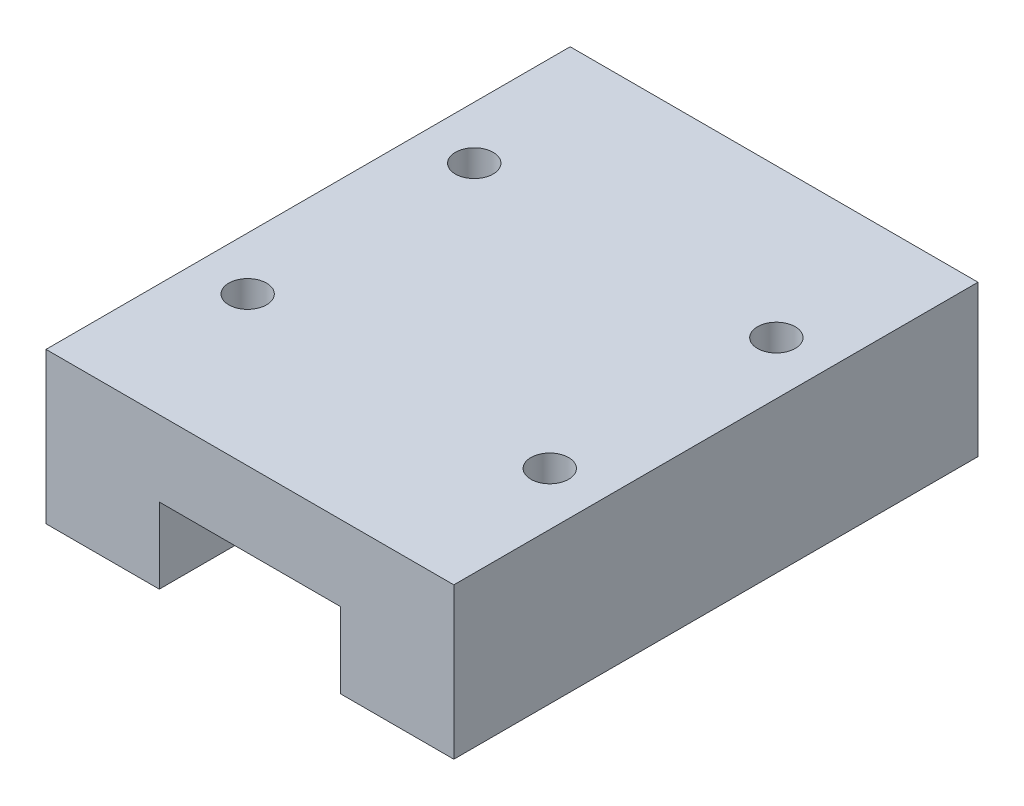
ISO-10303-21;
HEADER;
FILE_DESCRIPTION(('STEP AP214'),'2;1');
FILE_NAME('part.step','',(''),(''),'','','');
FILE_SCHEMA(('AUTOMOTIVE_DESIGN { 1 0 10303 214 1 1 1 1 }'));
ENDSEC;
DATA;
#1=APPLICATION_CONTEXT('core data for automotive mechanical design processes');
#2=APPLICATION_PROTOCOL_DEFINITION('international standard','automotive_design',2000,#1);
#3=PRODUCT_CONTEXT('',#1,'mechanical');
#4=PRODUCT('Part','Part','',(#3));
#5=PRODUCT_RELATED_PRODUCT_CATEGORY('part','',(#4));
#6=PRODUCT_DEFINITION_FORMATION('','',#4);
#7=PRODUCT_DEFINITION_CONTEXT('part definition',#1,'design');
#8=PRODUCT_DEFINITION('design','',#6,#7);
#9=PRODUCT_DEFINITION_SHAPE('','',#8);
#10=(LENGTH_UNIT() NAMED_UNIT(*) SI_UNIT(.MILLI.,.METRE.));
#11=(NAMED_UNIT(*) PLANE_ANGLE_UNIT() SI_UNIT($,.RADIAN.));
#12=(NAMED_UNIT(*) SI_UNIT($,.STERADIAN.) SOLID_ANGLE_UNIT());
#13=UNCERTAINTY_MEASURE_WITH_UNIT(LENGTH_MEASURE(1.E-05),#10,'distance_accuracy_value','');
#14=(GEOMETRIC_REPRESENTATION_CONTEXT(3) GLOBAL_UNCERTAINTY_ASSIGNED_CONTEXT((#13)) GLOBAL_UNIT_ASSIGNED_CONTEXT((#10,
#11,#12)) REPRESENTATION_CONTEXT('',''));
#15=CARTESIAN_POINT('',(0.,0.,0.));
#16=DIRECTION('',(0.,0.,1.));
#17=DIRECTION('',(1.,0.,0.));
#18=AXIS2_PLACEMENT_3D('',#15,#16,#17);
#19=CARTESIAN_POINT('',(3.5,3.99999999990541,9.85));
#20=DIRECTION('',(0.,1.,0.));
#21=DIRECTION('',(0.,0.,1.));
#22=AXIS2_PLACEMENT_3D('',#19,#20,#21);
#23=CONICAL_SURFACE('',#22,1.24999999988531,1.02974425865522);
#24=CARTESIAN_POINT('',(3.5,3.2489242261704,9.85));
#25=VERTEX_POINT('',#24);
#26=VERTEX_LOOP('',#25);
#27=FACE_BOUND('',#26,.T.);
#28=CARTESIAN_POINT('',(3.5,4.,9.85));
#29=DIRECTION('',(0.,1.,0.));
#30=DIRECTION('',(0.,0.,1.));
#31=AXIS2_PLACEMENT_3D('',#28,#29,#30);
#32=CIRCLE('',#31,1.24999999999999);
#33=CARTESIAN_POINT('',(3.5,4.,11.1));
#34=VERTEX_POINT('',#33);
#35=EDGE_CURVE('E94',#34,#34,#32,.T.);
#36=ORIENTED_EDGE('',*,*,#35,.T.);
#37=EDGE_LOOP('',(#36));
#38=FACE_BOUND('',#37,.T.);
#39=ADVANCED_FACE('F16',(#27,#38),#23,.F.);
#40=CARTESIAN_POINT('',(3.50000000000001,4.0000000000191,24.85));
#41=DIRECTION('',(0.,1.,0.));
#42=DIRECTION('',(0.,0.,1.));
#43=AXIS2_PLACEMENT_3D('',#40,#41,#42);
#44=CONICAL_SURFACE('',#43,1.24999999998536,1.02974425865232);
#45=CARTESIAN_POINT('',(3.50000000000001,3.24892422622725,24.85));
#46=VERTEX_POINT('',#45);
#47=VERTEX_LOOP('',#46);
#48=FACE_BOUND('',#47,.T.);
#49=CARTESIAN_POINT('',(3.50000000000001,4.,24.85));
#50=DIRECTION('',(0.,1.,0.));
#51=DIRECTION('',(0.,0.,1.));
#52=AXIS2_PLACEMENT_3D('',#49,#50,#51);
#53=CIRCLE('',#52,1.24999999999999);
#54=CARTESIAN_POINT('',(3.50000000000001,4.,26.1));
#55=VERTEX_POINT('',#54);
#56=EDGE_CURVE('E96',#55,#55,#53,.T.);
#57=ORIENTED_EDGE('',*,*,#56,.T.);
#58=EDGE_LOOP('',(#57));
#59=FACE_BOUND('',#58,.T.);
#60=ADVANCED_FACE('F91',(#48,#59),#44,.F.);
#61=CARTESIAN_POINT('',(23.5,3.99999999990541,24.85));
#62=DIRECTION('',(0.,1.,0.));
#63=DIRECTION('',(0.,0.,1.));
#64=AXIS2_PLACEMENT_3D('',#61,#62,#63);
#65=CONICAL_SURFACE('',#64,1.24999999987167,1.02974425844497);
#66=CARTESIAN_POINT('',(23.5,3.24892422608514,24.8500000002139));
#67=VERTEX_POINT('',#66);
#68=VERTEX_LOOP('',#67);
#69=FACE_BOUND('',#68,.T.);
#70=CARTESIAN_POINT('',(23.5,4.,24.85));
#71=DIRECTION('',(0.,1.,0.));
#72=DIRECTION('',(0.,0.,1.));
#73=AXIS2_PLACEMENT_3D('',#70,#71,#72);
#74=CIRCLE('',#73,1.24999999999999);
#75=CARTESIAN_POINT('',(23.5,4.,26.1));
#76=VERTEX_POINT('',#75);
#77=EDGE_CURVE('E100',#76,#76,#74,.T.);
#78=ORIENTED_EDGE('',*,*,#77,.T.);
#79=EDGE_LOOP('',(#78));
#80=FACE_BOUND('',#79,.T.);
#81=ADVANCED_FACE('F177',(#69,#80),#65,.F.);
#82=CARTESIAN_POINT('',(23.5,3.99999999990541,9.85));
#83=DIRECTION('',(0.,1.,0.));
#84=DIRECTION('',(0.,0.,1.));
#85=AXIS2_PLACEMENT_3D('',#82,#83,#84);
#86=CONICAL_SURFACE('',#85,1.24999999994215,1.02974425842119);
#87=CARTESIAN_POINT('',(23.5,3.24892422611356,9.85000000014224));
#88=VERTEX_POINT('',#87);
#89=VERTEX_LOOP('',#88);
#90=FACE_BOUND('',#89,.T.);
#91=CARTESIAN_POINT('',(23.5,4.,9.85));
#92=DIRECTION('',(0.,1.,0.));
#93=DIRECTION('',(0.,0.,1.));
#94=AXIS2_PLACEMENT_3D('',#91,#92,#93);
#95=CIRCLE('',#94,1.24999999999999);
#96=CARTESIAN_POINT('',(23.5,4.,11.1));
#97=VERTEX_POINT('',#96);
#98=EDGE_CURVE('E164',#97,#97,#95,.T.);
#99=ORIENTED_EDGE('',*,*,#98,.T.);
#100=EDGE_LOOP('',(#99));
#101=FACE_BOUND('',#100,.T.);
#102=ADVANCED_FACE('F242',(#90,#101),#86,.F.);
#103=CARTESIAN_POINT('',(7.5,0.,34.7));
#104=DIRECTION('',(0.,1.,0.));
#105=DIRECTION('',(-1.,0.,0.));
#106=AXIS2_PLACEMENT_3D('',#103,#104,#105);
#107=PLANE('',#106);
#108=DIRECTION('',(0.,0.,1.));
#109=VECTOR('',#108,1.);
#110=CARTESIAN_POINT('',(7.5,0.,34.7));
#111=LINE('',#110,#109);
#112=CARTESIAN_POINT('',(7.5,0.,0.));
#113=VERTEX_POINT('',#112);
#114=CARTESIAN_POINT('',(7.5,0.,34.7));
#115=VERTEX_POINT('',#114);
#116=EDGE_CURVE('E103',#113,#115,#111,.T.);
#117=ORIENTED_EDGE('',*,*,#116,.T.);
#118=DIRECTION('',(-1.,0.,0.));
#119=VECTOR('',#118,1.);
#120=CARTESIAN_POINT('',(0.,0.,34.7));
#121=LINE('',#120,#119);
#122=CARTESIAN_POINT('',(0.,0.,34.7));
#123=VERTEX_POINT('',#122);
#124=EDGE_CURVE('E146',#115,#123,#121,.T.);
#125=ORIENTED_EDGE('',*,*,#124,.T.);
#126=DIRECTION('',(0.,0.,-1.));
#127=VECTOR('',#126,1.);
#128=CARTESIAN_POINT('',(0.,0.,34.7));
#129=LINE('',#128,#127);
#130=CARTESIAN_POINT('',(0.,0.,0.));
#131=VERTEX_POINT('',#130);
#132=EDGE_CURVE('E140',#123,#131,#129,.T.);
#133=ORIENTED_EDGE('',*,*,#132,.T.);
#134=DIRECTION('',(-1.,0.,0.));
#135=VECTOR('',#134,1.);
#136=CARTESIAN_POINT('',(0.,0.,0.));
#137=LINE('',#136,#135);
#138=EDGE_CURVE('E138',#113,#131,#137,.T.);
#139=ORIENTED_EDGE('',*,*,#138,.F.);
#140=EDGE_LOOP('',(#117,#125,#133,#139));
#141=FACE_BOUND('',#140,.T.);
#142=ADVANCED_FACE('F238',(#141),#107,.F.);
#143=CARTESIAN_POINT('',(27.,0.,34.7));
#144=DIRECTION('',(0.,1.,0.));
#145=DIRECTION('',(-1.,0.,0.));
#146=AXIS2_PLACEMENT_3D('',#143,#144,#145);
#147=PLANE('',#146);
#148=DIRECTION('',(0.,0.,1.));
#149=VECTOR('',#148,1.);
#150=CARTESIAN_POINT('',(27.,0.,34.7));
#151=LINE('',#150,#149);
#152=CARTESIAN_POINT('',(27.,0.,0.));
#153=VERTEX_POINT('',#152);
#154=CARTESIAN_POINT('',(27.,0.,34.7));
#155=VERTEX_POINT('',#154);
#156=EDGE_CURVE('E163',#153,#155,#151,.T.);
#157=ORIENTED_EDGE('',*,*,#156,.T.);
#158=DIRECTION('',(-1.,0.,0.));
#159=VECTOR('',#158,1.);
#160=CARTESIAN_POINT('',(0.,0.,34.7));
#161=LINE('',#160,#159);
#162=CARTESIAN_POINT('',(19.5,0.,34.7));
#163=VERTEX_POINT('',#162);
#164=EDGE_CURVE('E157',#155,#163,#161,.T.);
#165=ORIENTED_EDGE('',*,*,#164,.T.);
#166=DIRECTION('',(0.,0.,-1.));
#167=VECTOR('',#166,1.);
#168=CARTESIAN_POINT('',(19.5,0.,34.7));
#169=LINE('',#168,#167);
#170=CARTESIAN_POINT('',(19.5,0.,0.));
#171=VERTEX_POINT('',#170);
#172=EDGE_CURVE('E170',#163,#171,#169,.T.);
#173=ORIENTED_EDGE('',*,*,#172,.T.);
#174=DIRECTION('',(-1.,0.,0.));
#175=VECTOR('',#174,1.);
#176=CARTESIAN_POINT('',(0.,0.,0.));
#177=LINE('',#176,#175);
#178=EDGE_CURVE('E132',#153,#171,#177,.T.);
#179=ORIENTED_EDGE('',*,*,#178,.F.);
#180=EDGE_LOOP('',(#157,#165,#173,#179));
#181=FACE_BOUND('',#180,.T.);
#182=ADVANCED_FACE('F234',(#181),#147,.F.);
#183=CARTESIAN_POINT('',(19.5,0.,34.7));
#184=DIRECTION('',(1.,0.,0.));
#185=DIRECTION('',(0.,0.,-1.));
#186=AXIS2_PLACEMENT_3D('',#183,#184,#185);
#187=PLANE('',#186);
#188=ORIENTED_EDGE('',*,*,#172,.F.);
#189=DIRECTION('',(0.,1.,0.));
#190=VECTOR('',#189,1.);
#191=CARTESIAN_POINT('',(19.5,0.,34.7));
#192=LINE('',#191,#190);
#193=CARTESIAN_POINT('',(19.5,5.,34.7));
#194=VERTEX_POINT('',#193);
#195=EDGE_CURVE('E154',#163,#194,#192,.T.);
#196=ORIENTED_EDGE('',*,*,#195,.T.);
#197=DIRECTION('',(0.,0.,1.));
#198=VECTOR('',#197,1.);
#199=CARTESIAN_POINT('',(19.5,5.,34.7));
#200=LINE('',#199,#198);
#201=CARTESIAN_POINT('',(19.5,5.,0.));
#202=VERTEX_POINT('',#201);
#203=EDGE_CURVE('E167',#194,#202,#200,.F.);
#204=ORIENTED_EDGE('',*,*,#203,.T.);
#205=DIRECTION('',(0.,1.,0.));
#206=VECTOR('',#205,1.);
#207=CARTESIAN_POINT('',(19.5,0.,0.));
#208=LINE('',#207,#206);
#209=EDGE_CURVE('E126',#171,#202,#208,.T.);
#210=ORIENTED_EDGE('',*,*,#209,.F.);
#211=EDGE_LOOP('',(#188,#196,#204,#210));
#212=FACE_BOUND('',#211,.T.);
#213=ADVANCED_FACE('F230',(#212),#187,.F.);
#214=CARTESIAN_POINT('',(19.5,5.,34.7));
#215=DIRECTION('',(0.,1.,0.));
#216=DIRECTION('',(-1.,0.,0.));
#217=AXIS2_PLACEMENT_3D('',#214,#215,#216);
#218=PLANE('',#217);
#219=ORIENTED_EDGE('',*,*,#203,.F.);
#220=DIRECTION('',(-1.,0.,0.));
#221=VECTOR('',#220,1.);
#222=CARTESIAN_POINT('',(0.,5.,34.7));
#223=LINE('',#222,#221);
#224=CARTESIAN_POINT('',(7.5,5.,34.7));
#225=VERTEX_POINT('',#224);
#226=EDGE_CURVE('E151',#194,#225,#223,.T.);
#227=ORIENTED_EDGE('',*,*,#226,.T.);
#228=DIRECTION('',(0.,0.,1.));
#229=VECTOR('',#228,1.);
#230=CARTESIAN_POINT('',(7.5,5.,34.7));
#231=LINE('',#230,#229);
#232=CARTESIAN_POINT('',(7.5,5.,0.));
#233=VERTEX_POINT('',#232);
#234=EDGE_CURVE('E97',#225,#233,#231,.F.);
#235=ORIENTED_EDGE('',*,*,#234,.T.);
#236=DIRECTION('',(-1.,0.,0.));
#237=VECTOR('',#236,1.);
#238=CARTESIAN_POINT('',(0.,5.,0.));
#239=LINE('',#238,#237);
#240=EDGE_CURVE('E122',#202,#233,#239,.T.);
#241=ORIENTED_EDGE('',*,*,#240,.F.);
#242=EDGE_LOOP('',(#219,#227,#235,#241));
#243=FACE_BOUND('',#242,.T.);
#244=ADVANCED_FACE('F226',(#243),#218,.F.);
#245=CARTESIAN_POINT('',(7.5,5.,34.7));
#246=DIRECTION('',(-1.,0.,0.));
#247=DIRECTION('',(0.,-1.,0.));
#248=AXIS2_PLACEMENT_3D('',#245,#246,#247);
#249=PLANE('',#248);
#250=ORIENTED_EDGE('',*,*,#234,.F.);
#251=DIRECTION('',(0.,1.,0.));
#252=VECTOR('',#251,1.);
#253=CARTESIAN_POINT('',(7.5,0.,34.7));
#254=LINE('',#253,#252);
#255=EDGE_CURVE('E148',#225,#115,#254,.F.);
#256=ORIENTED_EDGE('',*,*,#255,.T.);
#257=ORIENTED_EDGE('',*,*,#116,.F.);
#258=DIRECTION('',(0.,1.,0.));
#259=VECTOR('',#258,1.);
#260=CARTESIAN_POINT('',(7.5,0.,0.));
#261=LINE('',#260,#259);
#262=EDGE_CURVE('E118',#233,#113,#261,.F.);
#263=ORIENTED_EDGE('',*,*,#262,.F.);
#264=EDGE_LOOP('',(#250,#256,#257,#263));
#265=FACE_BOUND('',#264,.T.);
#266=ADVANCED_FACE('F223',(#265),#249,.F.);
#267=CARTESIAN_POINT('',(3.5,10.,9.85));
#268=DIRECTION('',(0.,1.,0.));
#269=DIRECTION('',(0.,0.,1.));
#270=AXIS2_PLACEMENT_3D('',#267,#268,#269);
#271=CYLINDRICAL_SURFACE('',#270,1.24999999999999);
#272=ORIENTED_EDGE('',*,*,#35,.F.);
#273=EDGE_LOOP('',(#272));
#274=FACE_BOUND('',#273,.T.);
#275=CARTESIAN_POINT('',(3.5,10.,9.85));
#276=DIRECTION('',(0.,1.,0.));
#277=DIRECTION('',(0.,0.,1.));
#278=AXIS2_PLACEMENT_3D('',#275,#276,#277);
#279=CIRCLE('',#278,1.24999999999999);
#280=CARTESIAN_POINT('',(3.5,10.,11.1));
#281=VERTEX_POINT('',#280);
#282=EDGE_CURVE('E19',#281,#281,#279,.T.);
#283=ORIENTED_EDGE('',*,*,#282,.T.);
#284=EDGE_LOOP('',(#283));
#285=FACE_BOUND('',#284,.T.);
#286=ADVANCED_FACE('F219',(#274,#285),#271,.F.);
#287=CARTESIAN_POINT('',(3.50000000000001,10.,24.85));
#288=DIRECTION('',(0.,1.,0.));
#289=DIRECTION('',(0.,0.,1.));
#290=AXIS2_PLACEMENT_3D('',#287,#288,#289);
#291=CYLINDRICAL_SURFACE('',#290,1.24999999999999);
#292=ORIENTED_EDGE('',*,*,#56,.F.);
#293=EDGE_LOOP('',(#292));
#294=FACE_BOUND('',#293,.T.);
#295=CARTESIAN_POINT('',(3.50000000000001,10.,24.85));
#296=DIRECTION('',(0.,1.,0.));
#297=DIRECTION('',(0.,0.,1.));
#298=AXIS2_PLACEMENT_3D('',#295,#296,#297);
#299=CIRCLE('',#298,1.24999999999999);
#300=CARTESIAN_POINT('',(3.50000000000001,10.,26.1));
#301=VERTEX_POINT('',#300);
#302=EDGE_CURVE('E113',#301,#301,#299,.T.);
#303=ORIENTED_EDGE('',*,*,#302,.T.);
#304=EDGE_LOOP('',(#303));
#305=FACE_BOUND('',#304,.T.);
#306=ADVANCED_FACE('F183',(#294,#305),#291,.F.);
#307=CARTESIAN_POINT('',(23.5,10.,24.85));
#308=DIRECTION('',(0.,1.,0.));
#309=DIRECTION('',(0.,0.,1.));
#310=AXIS2_PLACEMENT_3D('',#307,#308,#309);
#311=CYLINDRICAL_SURFACE('',#310,1.24999999999999);
#312=ORIENTED_EDGE('',*,*,#77,.F.);
#313=EDGE_LOOP('',(#312));
#314=FACE_BOUND('',#313,.T.);
#315=CARTESIAN_POINT('',(23.5,10.,24.85));
#316=DIRECTION('',(0.,1.,0.));
#317=DIRECTION('',(0.,0.,1.));
#318=AXIS2_PLACEMENT_3D('',#315,#316,#317);
#319=CIRCLE('',#318,1.24999999999999);
#320=CARTESIAN_POINT('',(23.5,10.,26.1));
#321=VERTEX_POINT('',#320);
#322=EDGE_CURVE('E111',#321,#321,#319,.T.);
#323=ORIENTED_EDGE('',*,*,#322,.T.);
#324=EDGE_LOOP('',(#323));
#325=FACE_BOUND('',#324,.T.);
#326=ADVANCED_FACE('F179',(#314,#325),#311,.F.);
#327=CARTESIAN_POINT('',(23.5,10.,9.85));
#328=DIRECTION('',(0.,1.,0.));
#329=DIRECTION('',(0.,0.,1.));
#330=AXIS2_PLACEMENT_3D('',#327,#328,#329);
#331=CYLINDRICAL_SURFACE('',#330,1.24999999999999);
#332=ORIENTED_EDGE('',*,*,#98,.F.);
#333=EDGE_LOOP('',(#332));
#334=FACE_BOUND('',#333,.T.);
#335=CARTESIAN_POINT('',(23.5,10.,9.85));
#336=DIRECTION('',(0.,1.,0.));
#337=DIRECTION('',(0.,0.,1.));
#338=AXIS2_PLACEMENT_3D('',#335,#336,#337);
#339=CIRCLE('',#338,1.24999999999999);
#340=CARTESIAN_POINT('',(23.5,10.,11.1));
#341=VERTEX_POINT('',#340);
#342=EDGE_CURVE('E107',#341,#341,#339,.T.);
#343=ORIENTED_EDGE('',*,*,#342,.T.);
#344=EDGE_LOOP('',(#343));
#345=FACE_BOUND('',#344,.T.);
#346=ADVANCED_FACE('F182',(#334,#345),#331,.F.);
#347=CARTESIAN_POINT('',(27.,10.,34.7));
#348=DIRECTION('',(-1.,0.,0.));
#349=DIRECTION('',(0.,0.,1.));
#350=AXIS2_PLACEMENT_3D('',#347,#348,#349);
#351=PLANE('',#350);
#352=DIRECTION('',(0.,0.,1.));
#353=VECTOR('',#352,1.);
#354=CARTESIAN_POINT('',(27.,10.,34.7));
#355=LINE('',#354,#353);
#356=CARTESIAN_POINT('',(27.,10.,0.));
#357=VERTEX_POINT('',#356);
#358=CARTESIAN_POINT('',(27.,10.,34.7));
#359=VERTEX_POINT('',#358);
#360=EDGE_CURVE('E110',#357,#359,#355,.T.);
#361=ORIENTED_EDGE('',*,*,#360,.T.);
#362=DIRECTION('',(0.,1.,0.));
#363=VECTOR('',#362,1.);
#364=CARTESIAN_POINT('',(27.,0.,34.7));
#365=LINE('',#364,#363);
#366=EDGE_CURVE('E160',#359,#155,#365,.F.);
#367=ORIENTED_EDGE('',*,*,#366,.T.);
#368=ORIENTED_EDGE('',*,*,#156,.F.);
#369=DIRECTION('',(0.,1.,0.));
#370=VECTOR('',#369,1.);
#371=CARTESIAN_POINT('',(27.,0.,0.));
#372=LINE('',#371,#370);
#373=EDGE_CURVE('E134',#357,#153,#372,.F.);
#374=ORIENTED_EDGE('',*,*,#373,.F.);
#375=EDGE_LOOP('',(#361,#367,#368,#374));
#376=FACE_BOUND('',#375,.T.);
#377=ADVANCED_FACE('F209',(#376),#351,.F.);
#378=CARTESIAN_POINT('',(0.,0.,34.7));
#379=DIRECTION('',(0.,0.,-1.));
#380=DIRECTION('',(-1.,0.,0.));
#381=AXIS2_PLACEMENT_3D('',#378,#379,#380);
#382=PLANE('',#381);
#383=ORIENTED_EDGE('',*,*,#255,.F.);
#384=ORIENTED_EDGE('',*,*,#226,.F.);
#385=ORIENTED_EDGE('',*,*,#195,.F.);
#386=ORIENTED_EDGE('',*,*,#164,.F.);
#387=ORIENTED_EDGE('',*,*,#366,.F.);
#388=DIRECTION('',(1.,0.,0.));
#389=VECTOR('',#388,1.);
#390=CARTESIAN_POINT('',(0.,10.,34.7));
#391=LINE('',#390,#389);
#392=CARTESIAN_POINT('',(0.,10.,34.7));
#393=VERTEX_POINT('',#392);
#394=EDGE_CURVE('E387',#359,#393,#391,.F.);
#395=ORIENTED_EDGE('',*,*,#394,.T.);
#396=DIRECTION('',(0.,1.,0.));
#397=VECTOR('',#396,1.);
#398=CARTESIAN_POINT('',(0.,0.,34.7));
#399=LINE('',#398,#397);
#400=EDGE_CURVE('E143',#393,#123,#399,.F.);
#401=ORIENTED_EDGE('',*,*,#400,.T.);
#402=ORIENTED_EDGE('',*,*,#124,.F.);
#403=EDGE_LOOP('',(#383,#384,#385,#386,#387,#395,#401,#402));
#404=FACE_BOUND('',#403,.T.);
#405=ADVANCED_FACE('F205',(#404),#382,.F.);
#406=CARTESIAN_POINT('',(0.,0.,34.7));
#407=DIRECTION('',(1.,0.,0.));
#408=DIRECTION('',(0.,0.,-1.));
#409=AXIS2_PLACEMENT_3D('',#406,#407,#408);
#410=PLANE('',#409);
#411=ORIENTED_EDGE('',*,*,#132,.F.);
#412=ORIENTED_EDGE('',*,*,#400,.F.);
#413=DIRECTION('',(0.,0.,1.));
#414=VECTOR('',#413,1.);
#415=CARTESIAN_POINT('',(0.,10.,34.7));
#416=LINE('',#415,#414);
#417=CARTESIAN_POINT('',(0.,10.,0.));
#418=VERTEX_POINT('',#417);
#419=EDGE_CURVE('E25',#393,#418,#416,.F.);
#420=ORIENTED_EDGE('',*,*,#419,.T.);
#421=DIRECTION('',(0.,1.,0.));
#422=VECTOR('',#421,1.);
#423=CARTESIAN_POINT('',(0.,0.,0.));
#424=LINE('',#423,#422);
#425=EDGE_CURVE('E33',#131,#418,#424,.T.);
#426=ORIENTED_EDGE('',*,*,#425,.F.);
#427=EDGE_LOOP('',(#411,#412,#420,#426));
#428=FACE_BOUND('',#427,.T.);
#429=ADVANCED_FACE('F198',(#428),#410,.F.);
#430=CARTESIAN_POINT('',(0.,0.,0.));
#431=DIRECTION('',(0.,0.,-1.));
#432=DIRECTION('',(-1.,0.,0.));
#433=AXIS2_PLACEMENT_3D('',#430,#431,#432);
#434=PLANE('',#433);
#435=ORIENTED_EDGE('',*,*,#240,.T.);
#436=ORIENTED_EDGE('',*,*,#262,.T.);
#437=ORIENTED_EDGE('',*,*,#138,.T.);
#438=ORIENTED_EDGE('',*,*,#425,.T.);
#439=DIRECTION('',(1.,0.,0.));
#440=VECTOR('',#439,1.);
#441=CARTESIAN_POINT('',(0.,10.,0.));
#442=LINE('',#441,#440);
#443=EDGE_CURVE('E11',#418,#357,#442,.T.);
#444=ORIENTED_EDGE('',*,*,#443,.T.);
#445=ORIENTED_EDGE('',*,*,#373,.T.);
#446=ORIENTED_EDGE('',*,*,#178,.T.);
#447=ORIENTED_EDGE('',*,*,#209,.T.);
#448=EDGE_LOOP('',(#435,#436,#437,#438,#444,#445,#446,#447));
#449=FACE_BOUND('',#448,.T.);
#450=ADVANCED_FACE('F190',(#449),#434,.T.);
#451=CARTESIAN_POINT('',(0.,10.,34.7));
#452=DIRECTION('',(0.,-1.,0.));
#453=DIRECTION('',(1.,0.,0.));
#454=AXIS2_PLACEMENT_3D('',#451,#452,#453);
#455=PLANE('',#454);
#456=ORIENTED_EDGE('',*,*,#419,.F.);
#457=ORIENTED_EDGE('',*,*,#394,.F.);
#458=ORIENTED_EDGE('',*,*,#360,.F.);
#459=ORIENTED_EDGE('',*,*,#443,.F.);
#460=EDGE_LOOP('',(#456,#457,#458,#459));
#461=FACE_BOUND('',#460,.T.);
#462=ORIENTED_EDGE('',*,*,#342,.F.);
#463=EDGE_LOOP('',(#462));
#464=FACE_BOUND('',#463,.T.);
#465=ORIENTED_EDGE('',*,*,#322,.F.);
#466=EDGE_LOOP('',(#465));
#467=FACE_BOUND('',#466,.T.);
#468=ORIENTED_EDGE('',*,*,#302,.F.);
#469=EDGE_LOOP('',(#468));
#470=FACE_BOUND('',#469,.T.);
#471=ORIENTED_EDGE('',*,*,#282,.F.);
#472=EDGE_LOOP('',(#471));
#473=FACE_BOUND('',#472,.T.);
#474=ADVANCED_FACE('F187',(#461,#464,#467,#470,#473),#455,.F.);
#475=CLOSED_SHELL('',(#39,#60,#81,#102,#142,#182,#213,#244,#266,#286,#306,#326,#346,#377,#405,
#429,#450,#474));
#476=MANIFOLD_SOLID_BREP('B1',#475);
#477=ADVANCED_BREP_SHAPE_REPRESENTATION('',(#18,#476),#14);
#478=SHAPE_DEFINITION_REPRESENTATION(#9,#477);
ENDSEC;
END-ISO-10303-21;
